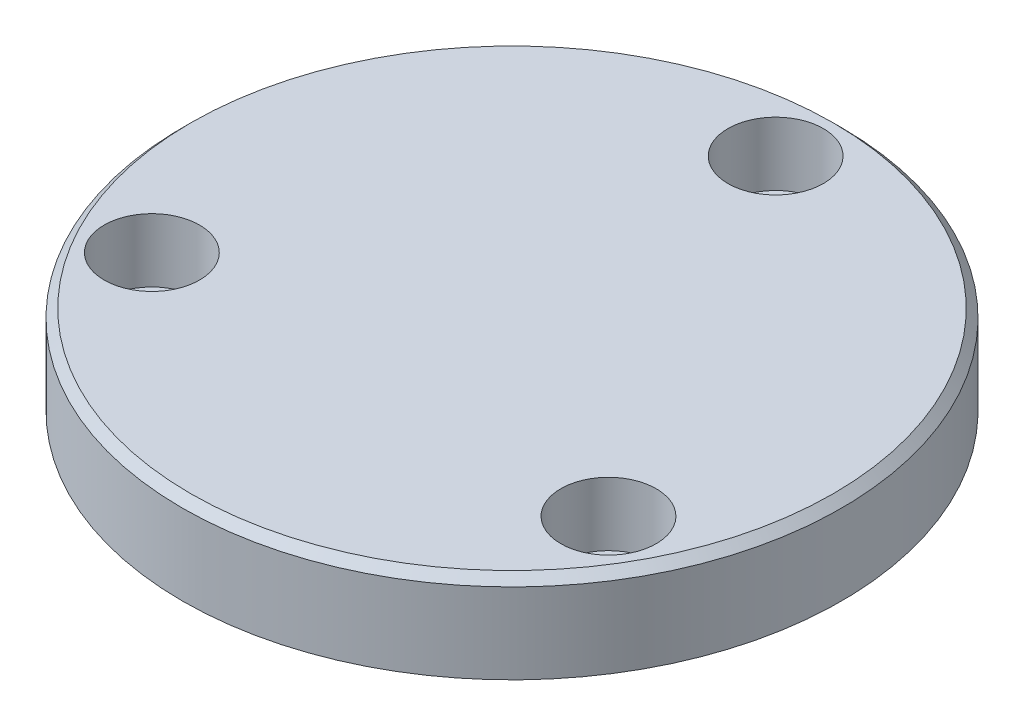
ISO-10303-21;
HEADER;
FILE_DESCRIPTION(('STEP AP214'),'2;1');
FILE_NAME('part.step','',(''),(''),'','','');
FILE_SCHEMA(('AUTOMOTIVE_DESIGN { 1 0 10303 214 1 1 1 1 }'));
ENDSEC;
DATA;
#1=APPLICATION_CONTEXT('core data for automotive mechanical design processes');
#2=APPLICATION_PROTOCOL_DEFINITION('international standard','automotive_design',2000,#1);
#3=PRODUCT_CONTEXT('',#1,'mechanical');
#4=PRODUCT('Part','Part','',(#3));
#5=PRODUCT_RELATED_PRODUCT_CATEGORY('part','',(#4));
#6=PRODUCT_DEFINITION_FORMATION('','',#4);
#7=PRODUCT_DEFINITION_CONTEXT('part definition',#1,'design');
#8=PRODUCT_DEFINITION('design','',#6,#7);
#9=PRODUCT_DEFINITION_SHAPE('','',#8);
#10=(LENGTH_UNIT() NAMED_UNIT(*) SI_UNIT(.MILLI.,.METRE.));
#11=(NAMED_UNIT(*) PLANE_ANGLE_UNIT() SI_UNIT($,.RADIAN.));
#12=(NAMED_UNIT(*) SI_UNIT($,.STERADIAN.) SOLID_ANGLE_UNIT());
#13=UNCERTAINTY_MEASURE_WITH_UNIT(LENGTH_MEASURE(1.E-05),#10,'distance_accuracy_value','');
#14=(GEOMETRIC_REPRESENTATION_CONTEXT(3) GLOBAL_UNCERTAINTY_ASSIGNED_CONTEXT((#13)) GLOBAL_UNIT_ASSIGNED_CONTEXT((#10,
#11,#12)) REPRESENTATION_CONTEXT('',''));
#15=CARTESIAN_POINT('',(0.,0.,0.));
#16=DIRECTION('',(0.,0.,1.));
#17=DIRECTION('',(1.,0.,0.));
#18=AXIS2_PLACEMENT_3D('',#15,#16,#17);
#19=CARTESIAN_POINT('',(0.,4.318,0.));
#20=DIRECTION('',(0.,-1.,0.));
#21=DIRECTION('',(0.,0.,-1.));
#22=AXIS2_PLACEMENT_3D('',#19,#20,#21);
#23=CYLINDRICAL_SURFACE('',#22,30.1625);
#24=CARTESIAN_POINT('',(0.,3.556,0.));
#25=DIRECTION('',(0.,1.,0.));
#26=DIRECTION('',(0.,0.,1.));
#27=AXIS2_PLACEMENT_3D('',#24,#25,#26);
#28=CIRCLE('',#27,30.1625);
#29=CARTESIAN_POINT('',(0.,3.556,30.1625));
#30=VERTEX_POINT('',#29);
#31=EDGE_CURVE('E12',#30,#30,#28,.F.);
#32=ORIENTED_EDGE('',*,*,#31,.T.);
#33=EDGE_LOOP('',(#32));
#34=FACE_BOUND('',#33,.T.);
#35=CARTESIAN_POINT('',(0.,-3.81,0.));
#36=DIRECTION('',(0.,-1.,0.));
#37=DIRECTION('',(0.,0.,-1.));
#38=AXIS2_PLACEMENT_3D('',#35,#36,#37);
#39=CIRCLE('',#38,30.1625);
#40=CARTESIAN_POINT('',(0.,-3.81,-30.1625));
#41=VERTEX_POINT('',#40);
#42=EDGE_CURVE('E94',#41,#41,#39,.T.);
#43=ORIENTED_EDGE('',*,*,#42,.F.);
#44=EDGE_LOOP('',(#43));
#45=FACE_BOUND('',#44,.T.);
#46=ADVANCED_FACE('F44',(#34,#45),#23,.T.);
#47=CARTESIAN_POINT('',(0.,-4.318,0.));
#48=DIRECTION('',(0.,1.,0.));
#49=DIRECTION('',(0.,0.,1.));
#50=AXIS2_PLACEMENT_3D('',#47,#48,#49);
#51=PLANE('',#50);
#52=CARTESIAN_POINT('',(-20.8971929933185,-4.318,12.0650000000001));
#53=DIRECTION('',(0.,1.,0.));
#54=DIRECTION('',(0.,0.,1.));
#55=AXIS2_PLACEMENT_3D('',#52,#53,#54);
#56=CIRCLE('',#55,2.45745);
#57=CARTESIAN_POINT('',(-20.8971929933185,-4.318,14.5224500000001));
#58=VERTEX_POINT('',#57);
#59=EDGE_CURVE('E79',#58,#58,#56,.T.);
#60=ORIENTED_EDGE('',*,*,#59,.T.);
#61=EDGE_LOOP('',(#60));
#62=FACE_BOUND('',#61,.T.);
#63=CARTESIAN_POINT('',(-20.8971929933185,-4.318,12.0650000000001));
#64=DIRECTION('',(0.,-1.,0.));
#65=DIRECTION('',(0.,0.,-1.));
#66=AXIS2_PLACEMENT_3D('',#63,#64,#65);
#67=CIRCLE('',#66,4.7625);
#68=CARTESIAN_POINT('',(-20.8971929933185,-4.318,7.3025000000001));
#69=VERTEX_POINT('',#68);
#70=EDGE_CURVE('E98',#69,#69,#67,.T.);
#71=ORIENTED_EDGE('',*,*,#70,.T.);
#72=EDGE_LOOP('',(#71));
#73=FACE_BOUND('',#72,.T.);
#74=ADVANCED_FACE('F132',(#62,#73),#51,.F.);
#75=CARTESIAN_POINT('',(0.,-4.318,-24.13));
#76=DIRECTION('',(0.,1.,0.));
#77=DIRECTION('',(0.,0.,1.));
#78=AXIS2_PLACEMENT_3D('',#75,#76,#77);
#79=CIRCLE('',#78,2.45745);
#80=CARTESIAN_POINT('',(0.,-4.318,-21.67255));
#81=VERTEX_POINT('',#80);
#82=EDGE_CURVE('E67',#81,#81,#79,.T.);
#83=ORIENTED_EDGE('',*,*,#82,.T.);
#84=EDGE_LOOP('',(#83));
#85=FACE_BOUND('',#84,.T.);
#86=CARTESIAN_POINT('',(0.,-4.318,-24.13));
#87=DIRECTION('',(0.,-1.,0.));
#88=DIRECTION('',(0.,0.,-1.));
#89=AXIS2_PLACEMENT_3D('',#86,#87,#88);
#90=CIRCLE('',#89,4.7625);
#91=CARTESIAN_POINT('',(0.,-4.318,-28.8925));
#92=VERTEX_POINT('',#91);
#93=EDGE_CURVE('E104',#92,#92,#90,.T.);
#94=ORIENTED_EDGE('',*,*,#93,.T.);
#95=EDGE_LOOP('',(#94));
#96=FACE_BOUND('',#95,.T.);
#97=ADVANCED_FACE('F136',(#85,#96),#51,.F.);
#98=CARTESIAN_POINT('',(20.8971929933186,-4.318,12.0649999999998));
#99=DIRECTION('',(0.,1.,0.));
#100=DIRECTION('',(0.,0.,1.));
#101=AXIS2_PLACEMENT_3D('',#98,#99,#100);
#102=CIRCLE('',#101,2.45745);
#103=CARTESIAN_POINT('',(20.8971929933186,-4.318,14.5224499999998));
#104=VERTEX_POINT('',#103);
#105=EDGE_CURVE('E91',#104,#104,#102,.T.);
#106=ORIENTED_EDGE('',*,*,#105,.T.);
#107=EDGE_LOOP('',(#106));
#108=FACE_BOUND('',#107,.T.);
#109=CARTESIAN_POINT('',(20.8971929933186,-4.318,12.0649999999998));
#110=DIRECTION('',(0.,-1.,0.));
#111=DIRECTION('',(0.,0.,-1.));
#112=AXIS2_PLACEMENT_3D('',#109,#110,#111);
#113=CIRCLE('',#112,4.7625);
#114=CARTESIAN_POINT('',(20.8971929933186,-4.318,7.30249999999981));
#115=VERTEX_POINT('',#114);
#116=EDGE_CURVE('E110',#115,#115,#113,.T.);
#117=ORIENTED_EDGE('',*,*,#116,.T.);
#118=EDGE_LOOP('',(#117));
#119=FACE_BOUND('',#118,.T.);
#120=ADVANCED_FACE('F139',(#108,#119),#51,.F.);
#121=CARTESIAN_POINT('',(0.,4.318,0.));
#122=DIRECTION('',(0.,1.,0.));
#123=DIRECTION('',(0.,0.,1.));
#124=AXIS2_PLACEMENT_3D('',#121,#122,#123);
#125=PLANE('',#124);
#126=CARTESIAN_POINT('',(0.,4.318,0.));
#127=DIRECTION('',(0.,1.,0.));
#128=DIRECTION('',(0.,0.,1.));
#129=AXIS2_PLACEMENT_3D('',#126,#127,#128);
#130=CIRCLE('',#129,29.4005);
#131=CARTESIAN_POINT('',(0.,4.318,29.4005));
#132=VERTEX_POINT('',#131);
#133=EDGE_CURVE('E51',#132,#132,#130,.T.);
#134=ORIENTED_EDGE('',*,*,#133,.T.);
#135=EDGE_LOOP('',(#134));
#136=FACE_BOUND('',#135,.T.);
#137=CARTESIAN_POINT('',(20.8971929933186,4.318,12.0649999999998));
#138=DIRECTION('',(0.,1.,0.));
#139=DIRECTION('',(0.,0.,1.));
#140=AXIS2_PLACEMENT_3D('',#137,#138,#139);
#141=CIRCLE('',#140,4.365625);
#142=CARTESIAN_POINT('',(20.8971929933186,4.318,16.4306249999998));
#143=VERTEX_POINT('',#142);
#144=EDGE_CURVE('E82',#143,#143,#141,.T.);
#145=ORIENTED_EDGE('',*,*,#144,.F.);
#146=EDGE_LOOP('',(#145));
#147=FACE_BOUND('',#146,.T.);
#148=CARTESIAN_POINT('',(-20.8971929933185,4.318,12.0650000000001));
#149=DIRECTION('',(0.,1.,0.));
#150=DIRECTION('',(0.,0.,1.));
#151=AXIS2_PLACEMENT_3D('',#148,#149,#150);
#152=CIRCLE('',#151,4.365625);
#153=CARTESIAN_POINT('',(-20.8971929933185,4.318,16.4306250000001));
#154=VERTEX_POINT('',#153);
#155=EDGE_CURVE('E70',#154,#154,#152,.T.);
#156=ORIENTED_EDGE('',*,*,#155,.F.);
#157=EDGE_LOOP('',(#156));
#158=FACE_BOUND('',#157,.T.);
#159=CARTESIAN_POINT('',(0.,4.318,-24.13));
#160=DIRECTION('',(0.,1.,0.));
#161=DIRECTION('',(0.,0.,1.));
#162=AXIS2_PLACEMENT_3D('',#159,#160,#161);
#163=CIRCLE('',#162,4.365625);
#164=CARTESIAN_POINT('',(0.,4.318,-19.764375));
#165=VERTEX_POINT('',#164);
#166=EDGE_CURVE('E55',#165,#165,#163,.T.);
#167=ORIENTED_EDGE('',*,*,#166,.F.);
#168=EDGE_LOOP('',(#167));
#169=FACE_BOUND('',#168,.T.);
#170=ADVANCED_FACE('F141',(#136,#147,#158,#169),#125,.T.);
#171=CARTESIAN_POINT('',(0.,4.318,-24.13));
#172=DIRECTION('',(0.,1.,0.));
#173=DIRECTION('',(0.,0.,1.));
#174=AXIS2_PLACEMENT_3D('',#171,#172,#173);
#175=CYLINDRICAL_SURFACE('',#174,4.365625);
#176=CARTESIAN_POINT('',(0.,-1.4986,-24.13));
#177=DIRECTION('',(0.,1.,0.));
#178=DIRECTION('',(0.,0.,1.));
#179=AXIS2_PLACEMENT_3D('',#176,#177,#178);
#180=CIRCLE('',#179,4.365625);
#181=CARTESIAN_POINT('',(0.,-1.4986,-19.764375));
#182=VERTEX_POINT('',#181);
#183=EDGE_CURVE('E59',#182,#182,#180,.T.);
#184=ORIENTED_EDGE('',*,*,#183,.F.);
#185=EDGE_LOOP('',(#184));
#186=FACE_BOUND('',#185,.T.);
#187=ORIENTED_EDGE('',*,*,#166,.T.);
#188=EDGE_LOOP('',(#187));
#189=FACE_BOUND('',#188,.T.);
#190=ADVANCED_FACE('F144',(#186,#189),#175,.F.);
#191=CARTESIAN_POINT('',(2.45745,-1.4986,-24.13));
#192=DIRECTION('',(0.,-1.,0.));
#193=DIRECTION('',(0.,0.,-1.));
#194=AXIS2_PLACEMENT_3D('',#191,#192,#193);
#195=PLANE('',#194);
#196=CARTESIAN_POINT('',(0.,-1.4986,-24.13));
#197=DIRECTION('',(0.,1.,0.));
#198=DIRECTION('',(0.,0.,1.));
#199=AXIS2_PLACEMENT_3D('',#196,#197,#198);
#200=CIRCLE('',#199,2.45745);
#201=CARTESIAN_POINT('',(0.,-1.4986,-21.67255));
#202=VERTEX_POINT('',#201);
#203=EDGE_CURVE('E64',#202,#202,#200,.T.);
#204=ORIENTED_EDGE('',*,*,#203,.F.);
#205=EDGE_LOOP('',(#204));
#206=FACE_BOUND('',#205,.T.);
#207=ORIENTED_EDGE('',*,*,#183,.T.);
#208=EDGE_LOOP('',(#207));
#209=FACE_BOUND('',#208,.T.);
#210=ADVANCED_FACE('F147',(#206,#209),#195,.F.);
#211=CARTESIAN_POINT('',(0.,4.318,-24.13));
#212=DIRECTION('',(0.,1.,0.));
#213=DIRECTION('',(0.,0.,1.));
#214=AXIS2_PLACEMENT_3D('',#211,#212,#213);
#215=CYLINDRICAL_SURFACE('',#214,2.45745);
#216=ORIENTED_EDGE('',*,*,#82,.F.);
#217=EDGE_LOOP('',(#216));
#218=FACE_BOUND('',#217,.T.);
#219=ORIENTED_EDGE('',*,*,#203,.T.);
#220=EDGE_LOOP('',(#219));
#221=FACE_BOUND('',#220,.T.);
#222=ADVANCED_FACE('F151',(#218,#221),#215,.F.);
#223=CARTESIAN_POINT('',(-20.8971929933185,4.318,12.0650000000001));
#224=DIRECTION('',(0.,1.,0.));
#225=DIRECTION('',(0.,0.,1.));
#226=AXIS2_PLACEMENT_3D('',#223,#224,#225);
#227=CYLINDRICAL_SURFACE('',#226,4.365625);
#228=CARTESIAN_POINT('',(-20.8971929933185,-1.4986,12.0650000000001));
#229=DIRECTION('',(0.,1.,0.));
#230=DIRECTION('',(0.,0.,1.));
#231=AXIS2_PLACEMENT_3D('',#228,#229,#230);
#232=CIRCLE('',#231,4.365625);
#233=CARTESIAN_POINT('',(-20.8971929933185,-1.4986,16.4306250000001));
#234=VERTEX_POINT('',#233);
#235=EDGE_CURVE('E73',#234,#234,#232,.T.);
#236=ORIENTED_EDGE('',*,*,#235,.F.);
#237=EDGE_LOOP('',(#236));
#238=FACE_BOUND('',#237,.T.);
#239=ORIENTED_EDGE('',*,*,#155,.T.);
#240=EDGE_LOOP('',(#239));
#241=FACE_BOUND('',#240,.T.);
#242=ADVANCED_FACE('F155',(#238,#241),#227,.F.);
#243=CARTESIAN_POINT('',(-18.4397429933185,-1.4986,12.0650000000001));
#244=DIRECTION('',(0.,-1.,0.));
#245=DIRECTION('',(0.,0.,-1.));
#246=AXIS2_PLACEMENT_3D('',#243,#244,#245);
#247=PLANE('',#246);
#248=CARTESIAN_POINT('',(-20.8971929933185,-1.4986,12.0650000000001));
#249=DIRECTION('',(0.,1.,0.));
#250=DIRECTION('',(0.,0.,1.));
#251=AXIS2_PLACEMENT_3D('',#248,#249,#250);
#252=CIRCLE('',#251,2.45745);
#253=CARTESIAN_POINT('',(-20.8971929933185,-1.4986,14.5224500000001));
#254=VERTEX_POINT('',#253);
#255=EDGE_CURVE('E76',#254,#254,#252,.T.);
#256=ORIENTED_EDGE('',*,*,#255,.F.);
#257=EDGE_LOOP('',(#256));
#258=FACE_BOUND('',#257,.T.);
#259=ORIENTED_EDGE('',*,*,#235,.T.);
#260=EDGE_LOOP('',(#259));
#261=FACE_BOUND('',#260,.T.);
#262=ADVANCED_FACE('F159',(#258,#261),#247,.F.);
#263=CARTESIAN_POINT('',(-20.8971929933185,4.318,12.0650000000001));
#264=DIRECTION('',(0.,1.,0.));
#265=DIRECTION('',(0.,0.,1.));
#266=AXIS2_PLACEMENT_3D('',#263,#264,#265);
#267=CYLINDRICAL_SURFACE('',#266,2.45745);
#268=ORIENTED_EDGE('',*,*,#59,.F.);
#269=EDGE_LOOP('',(#268));
#270=FACE_BOUND('',#269,.T.);
#271=ORIENTED_EDGE('',*,*,#255,.T.);
#272=EDGE_LOOP('',(#271));
#273=FACE_BOUND('',#272,.T.);
#274=ADVANCED_FACE('F163',(#270,#273),#267,.F.);
#275=CARTESIAN_POINT('',(20.8971929933186,4.318,12.0649999999998));
#276=DIRECTION('',(0.,1.,0.));
#277=DIRECTION('',(0.,0.,1.));
#278=AXIS2_PLACEMENT_3D('',#275,#276,#277);
#279=CYLINDRICAL_SURFACE('',#278,4.365625);
#280=CARTESIAN_POINT('',(20.8971929933186,-1.4986,12.0649999999998));
#281=DIRECTION('',(0.,1.,0.));
#282=DIRECTION('',(0.,0.,1.));
#283=AXIS2_PLACEMENT_3D('',#280,#281,#282);
#284=CIRCLE('',#283,4.365625);
#285=CARTESIAN_POINT('',(20.8971929933186,-1.4986,16.4306249999998));
#286=VERTEX_POINT('',#285);
#287=EDGE_CURVE('E85',#286,#286,#284,.T.);
#288=ORIENTED_EDGE('',*,*,#287,.F.);
#289=EDGE_LOOP('',(#288));
#290=FACE_BOUND('',#289,.T.);
#291=ORIENTED_EDGE('',*,*,#144,.T.);
#292=EDGE_LOOP('',(#291));
#293=FACE_BOUND('',#292,.T.);
#294=ADVANCED_FACE('F167',(#290,#293),#279,.F.);
#295=CARTESIAN_POINT('',(23.3546429933186,-1.4986,12.0649999999998));
#296=DIRECTION('',(0.,-1.,0.));
#297=DIRECTION('',(0.,0.,-1.));
#298=AXIS2_PLACEMENT_3D('',#295,#296,#297);
#299=PLANE('',#298);
#300=CARTESIAN_POINT('',(20.8971929933186,-1.4986,12.0649999999998));
#301=DIRECTION('',(0.,1.,0.));
#302=DIRECTION('',(0.,0.,1.));
#303=AXIS2_PLACEMENT_3D('',#300,#301,#302);
#304=CIRCLE('',#303,2.45745);
#305=CARTESIAN_POINT('',(20.8971929933186,-1.4986,14.5224499999998));
#306=VERTEX_POINT('',#305);
#307=EDGE_CURVE('E88',#306,#306,#304,.T.);
#308=ORIENTED_EDGE('',*,*,#307,.F.);
#309=EDGE_LOOP('',(#308));
#310=FACE_BOUND('',#309,.T.);
#311=ORIENTED_EDGE('',*,*,#287,.T.);
#312=EDGE_LOOP('',(#311));
#313=FACE_BOUND('',#312,.T.);
#314=ADVANCED_FACE('F171',(#310,#313),#299,.F.);
#315=CARTESIAN_POINT('',(20.8971929933186,4.318,12.0649999999998));
#316=DIRECTION('',(0.,1.,0.));
#317=DIRECTION('',(0.,0.,1.));
#318=AXIS2_PLACEMENT_3D('',#315,#316,#317);
#319=CYLINDRICAL_SURFACE('',#318,2.45745);
#320=ORIENTED_EDGE('',*,*,#105,.F.);
#321=EDGE_LOOP('',(#320));
#322=FACE_BOUND('',#321,.T.);
#323=ORIENTED_EDGE('',*,*,#307,.T.);
#324=EDGE_LOOP('',(#323));
#325=FACE_BOUND('',#324,.T.);
#326=ADVANCED_FACE('F123',(#322,#325),#319,.F.);
#327=CARTESIAN_POINT('',(0.,-3.81,0.));
#328=DIRECTION('',(0.,-1.,0.));
#329=DIRECTION('',(0.,0.,-1.));
#330=AXIS2_PLACEMENT_3D('',#327,#328,#329);
#331=PLANE('',#330);
#332=CARTESIAN_POINT('',(20.8971929933186,-3.81,12.0649999999998));
#333=DIRECTION('',(0.,-1.,0.));
#334=DIRECTION('',(0.,0.,-1.));
#335=AXIS2_PLACEMENT_3D('',#332,#333,#334);
#336=CIRCLE('',#335,4.7625);
#337=CARTESIAN_POINT('',(20.8971929933186,-3.81,7.30249999999981));
#338=VERTEX_POINT('',#337);
#339=EDGE_CURVE('E107',#338,#338,#336,.T.);
#340=ORIENTED_EDGE('',*,*,#339,.F.);
#341=EDGE_LOOP('',(#340));
#342=FACE_BOUND('',#341,.T.);
#343=CARTESIAN_POINT('',(0.,-3.81,-24.13));
#344=DIRECTION('',(0.,-1.,0.));
#345=DIRECTION('',(0.,0.,-1.));
#346=AXIS2_PLACEMENT_3D('',#343,#344,#345);
#347=CIRCLE('',#346,4.7625);
#348=CARTESIAN_POINT('',(0.,-3.81,-28.8925));
#349=VERTEX_POINT('',#348);
#350=EDGE_CURVE('E101',#349,#349,#347,.T.);
#351=ORIENTED_EDGE('',*,*,#350,.F.);
#352=EDGE_LOOP('',(#351));
#353=FACE_BOUND('',#352,.T.);
#354=CARTESIAN_POINT('',(-20.8971929933185,-3.81,12.0650000000001));
#355=DIRECTION('',(0.,-1.,0.));
#356=DIRECTION('',(0.,0.,-1.));
#357=AXIS2_PLACEMENT_3D('',#354,#355,#356);
#358=CIRCLE('',#357,4.7625);
#359=CARTESIAN_POINT('',(-20.8971929933185,-3.81,7.3025000000001));
#360=VERTEX_POINT('',#359);
#361=EDGE_CURVE('E97',#360,#360,#358,.T.);
#362=ORIENTED_EDGE('',*,*,#361,.F.);
#363=EDGE_LOOP('',(#362));
#364=FACE_BOUND('',#363,.T.);
#365=ORIENTED_EDGE('',*,*,#42,.T.);
#366=EDGE_LOOP('',(#365));
#367=FACE_BOUND('',#366,.T.);
#368=ADVANCED_FACE('F119',(#342,#353,#364,#367),#331,.T.);
#369=CARTESIAN_POINT('',(-20.8971929933185,-3.81,12.0650000000001));
#370=DIRECTION('',(0.,-1.,0.));
#371=DIRECTION('',(0.,0.,-1.));
#372=AXIS2_PLACEMENT_3D('',#369,#370,#371);
#373=CYLINDRICAL_SURFACE('',#372,4.7625);
#374=ORIENTED_EDGE('',*,*,#361,.T.);
#375=EDGE_LOOP('',(#374));
#376=FACE_BOUND('',#375,.T.);
#377=ORIENTED_EDGE('',*,*,#70,.F.);
#378=EDGE_LOOP('',(#377));
#379=FACE_BOUND('',#378,.T.);
#380=ADVANCED_FACE('F122',(#376,#379),#373,.T.);
#381=CARTESIAN_POINT('',(0.,-3.81,-24.13));
#382=DIRECTION('',(0.,-1.,0.));
#383=DIRECTION('',(0.,0.,-1.));
#384=AXIS2_PLACEMENT_3D('',#381,#382,#383);
#385=CYLINDRICAL_SURFACE('',#384,4.7625);
#386=ORIENTED_EDGE('',*,*,#350,.T.);
#387=EDGE_LOOP('',(#386));
#388=FACE_BOUND('',#387,.T.);
#389=ORIENTED_EDGE('',*,*,#93,.F.);
#390=EDGE_LOOP('',(#389));
#391=FACE_BOUND('',#390,.T.);
#392=ADVANCED_FACE('F181',(#388,#391),#385,.T.);
#393=CARTESIAN_POINT('',(20.8971929933186,-3.81,12.0649999999998));
#394=DIRECTION('',(0.,-1.,0.));
#395=DIRECTION('',(0.,0.,-1.));
#396=AXIS2_PLACEMENT_3D('',#393,#394,#395);
#397=CYLINDRICAL_SURFACE('',#396,4.7625);
#398=ORIENTED_EDGE('',*,*,#339,.T.);
#399=EDGE_LOOP('',(#398));
#400=FACE_BOUND('',#399,.T.);
#401=ORIENTED_EDGE('',*,*,#116,.F.);
#402=EDGE_LOOP('',(#401));
#403=FACE_BOUND('',#402,.T.);
#404=ADVANCED_FACE('F116',(#400,#403),#397,.T.);
#405=CARTESIAN_POINT('',(0.,4.318,0.));
#406=DIRECTION('',(0.,-1.,0.));
#407=DIRECTION('',(0.,0.,-1.));
#408=AXIS2_PLACEMENT_3D('',#405,#406,#407);
#409=CONICAL_SURFACE('',#408,29.4005,0.785398163397446);
#410=ORIENTED_EDGE('',*,*,#31,.F.);
#411=EDGE_LOOP('',(#410));
#412=FACE_BOUND('',#411,.T.);
#413=ORIENTED_EDGE('',*,*,#133,.F.);
#414=EDGE_LOOP('',(#413));
#415=FACE_BOUND('',#414,.T.);
#416=ADVANCED_FACE('F46',(#412,#415),#409,.T.);
#417=CLOSED_SHELL('',(#46,#74,#97,#120,#170,#190,#210,#222,#242,#262,#274,#294,#314,#326,#368,
#380,#392,#404,#416));
#418=MANIFOLD_SOLID_BREP('B2',#417);
#419=ADVANCED_BREP_SHAPE_REPRESENTATION('',(#18,#418),#14);
#420=SHAPE_DEFINITION_REPRESENTATION(#9,#419);
ENDSEC;
END-ISO-10303-21;
